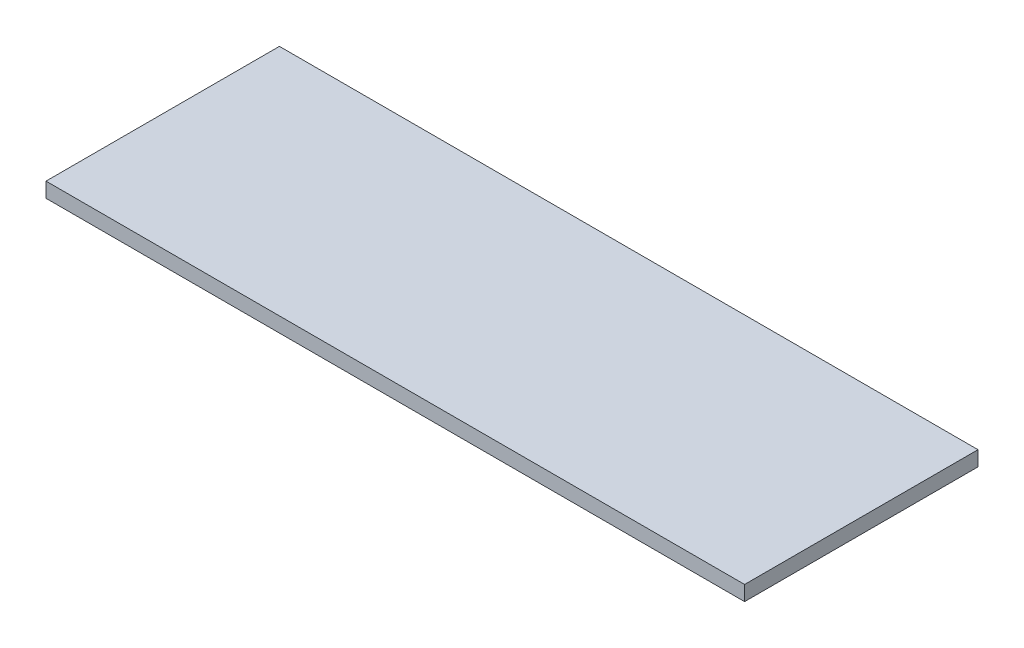
ISO-10303-21;
HEADER;
FILE_DESCRIPTION(('STEP AP214'),'2;1');
FILE_NAME('part.step','',(''),(''),'','','');
FILE_SCHEMA(('AUTOMOTIVE_DESIGN { 1 0 10303 214 1 1 1 1 }'));
ENDSEC;
DATA;
#1=APPLICATION_CONTEXT('core data for automotive mechanical design processes');
#2=APPLICATION_PROTOCOL_DEFINITION('international standard','automotive_design',2000,#1);
#3=PRODUCT_CONTEXT('',#1,'mechanical');
#4=PRODUCT('Part','Part','',(#3));
#5=PRODUCT_RELATED_PRODUCT_CATEGORY('part','',(#4));
#6=PRODUCT_DEFINITION_FORMATION('','',#4);
#7=PRODUCT_DEFINITION_CONTEXT('part definition',#1,'design');
#8=PRODUCT_DEFINITION('design','',#6,#7);
#9=PRODUCT_DEFINITION_SHAPE('','',#8);
#10=(LENGTH_UNIT() NAMED_UNIT(*) SI_UNIT(.MILLI.,.METRE.));
#11=(NAMED_UNIT(*) PLANE_ANGLE_UNIT() SI_UNIT($,.RADIAN.));
#12=(NAMED_UNIT(*) SI_UNIT($,.STERADIAN.) SOLID_ANGLE_UNIT());
#13=UNCERTAINTY_MEASURE_WITH_UNIT(LENGTH_MEASURE(1.E-05),#10,'distance_accuracy_value','');
#14=(GEOMETRIC_REPRESENTATION_CONTEXT(3) GLOBAL_UNCERTAINTY_ASSIGNED_CONTEXT((#13)) GLOBAL_UNIT_ASSIGNED_CONTEXT((#10,
#11,#12)) REPRESENTATION_CONTEXT('',''));
#15=CARTESIAN_POINT('',(0.,0.,0.));
#16=DIRECTION('',(0.,0.,1.));
#17=DIRECTION('',(1.,0.,0.));
#18=AXIS2_PLACEMENT_3D('',#15,#16,#17);
#19=CARTESIAN_POINT('',(-422.,18.,141.));
#20=DIRECTION('',(1.,0.,0.));
#21=DIRECTION('',(0.,0.,-1.));
#22=AXIS2_PLACEMENT_3D('',#19,#20,#21);
#23=PLANE('',#22);
#24=DIRECTION('',(0.,0.,1.));
#25=VECTOR('',#24,1.);
#26=CARTESIAN_POINT('',(-422.,0.,141.));
#27=LINE('',#26,#25);
#28=CARTESIAN_POINT('',(-422.,0.,-141.));
#29=VERTEX_POINT('',#28);
#30=CARTESIAN_POINT('',(-422.,0.,141.));
#31=VERTEX_POINT('',#30);
#32=EDGE_CURVE('E98',#29,#31,#27,.T.);
#33=ORIENTED_EDGE('',*,*,#32,.T.);
#34=DIRECTION('',(0.,-1.,0.));
#35=VECTOR('',#34,1.);
#36=CARTESIAN_POINT('',(-422.,18.,141.));
#37=LINE('',#36,#35);
#38=CARTESIAN_POINT('',(-422.,18.,141.));
#39=VERTEX_POINT('',#38);
#40=EDGE_CURVE('E11',#39,#31,#37,.T.);
#41=ORIENTED_EDGE('',*,*,#40,.F.);
#42=DIRECTION('',(0.,0.,1.));
#43=VECTOR('',#42,1.);
#44=CARTESIAN_POINT('',(-422.,18.,141.));
#45=LINE('',#44,#43);
#46=CARTESIAN_POINT('',(-422.,18.,-141.));
#47=VERTEX_POINT('',#46);
#48=EDGE_CURVE('E86',#47,#39,#45,.T.);
#49=ORIENTED_EDGE('',*,*,#48,.F.);
#50=DIRECTION('',(0.,-1.,0.));
#51=VECTOR('',#50,1.);
#52=CARTESIAN_POINT('',(-422.,18.,-141.));
#53=LINE('',#52,#51);
#54=EDGE_CURVE('E94',#47,#29,#53,.T.);
#55=ORIENTED_EDGE('',*,*,#54,.T.);
#56=EDGE_LOOP('',(#33,#41,#49,#55));
#57=FACE_BOUND('',#56,.T.);
#58=ADVANCED_FACE('F35',(#57),#23,.F.);
#59=CARTESIAN_POINT('',(422.,18.,141.));
#60=DIRECTION('',(0.,0.,-1.));
#61=DIRECTION('',(-1.,0.,0.));
#62=AXIS2_PLACEMENT_3D('',#59,#60,#61);
#63=PLANE('',#62);
#64=DIRECTION('',(1.,0.,0.));
#65=VECTOR('',#64,1.);
#66=CARTESIAN_POINT('',(422.,0.,141.));
#67=LINE('',#66,#65);
#68=CARTESIAN_POINT('',(422.,0.,141.));
#69=VERTEX_POINT('',#68);
#70=EDGE_CURVE('E90',#31,#69,#67,.T.);
#71=ORIENTED_EDGE('',*,*,#70,.T.);
#72=DIRECTION('',(0.,-1.,0.));
#73=VECTOR('',#72,1.);
#74=CARTESIAN_POINT('',(422.,18.,141.));
#75=LINE('',#74,#73);
#76=CARTESIAN_POINT('',(422.,18.,141.));
#77=VERTEX_POINT('',#76);
#78=EDGE_CURVE('E43',#77,#69,#75,.T.);
#79=ORIENTED_EDGE('',*,*,#78,.F.);
#80=DIRECTION('',(1.,0.,0.));
#81=VECTOR('',#80,1.);
#82=CARTESIAN_POINT('',(422.,18.,141.));
#83=LINE('',#82,#81);
#84=EDGE_CURVE('E81',#39,#77,#83,.T.);
#85=ORIENTED_EDGE('',*,*,#84,.F.);
#86=ORIENTED_EDGE('',*,*,#40,.T.);
#87=EDGE_LOOP('',(#71,#79,#85,#86));
#88=FACE_BOUND('',#87,.T.);
#89=ADVANCED_FACE('F89',(#88),#63,.F.);
#90=CARTESIAN_POINT('',(422.,18.,141.));
#91=DIRECTION('',(-1.,0.,0.));
#92=DIRECTION('',(0.,0.,1.));
#93=AXIS2_PLACEMENT_3D('',#90,#91,#92);
#94=PLANE('',#93);
#95=DIRECTION('',(0.,0.,-1.));
#96=VECTOR('',#95,1.);
#97=CARTESIAN_POINT('',(422.,0.,141.));
#98=LINE('',#97,#96);
#99=CARTESIAN_POINT('',(422.,0.,-141.));
#100=VERTEX_POINT('',#99);
#101=EDGE_CURVE('E68',#69,#100,#98,.T.);
#102=ORIENTED_EDGE('',*,*,#101,.T.);
#103=DIRECTION('',(0.,-1.,0.));
#104=VECTOR('',#103,1.);
#105=CARTESIAN_POINT('',(422.,18.,-141.));
#106=LINE('',#105,#104);
#107=CARTESIAN_POINT('',(422.,18.,-141.));
#108=VERTEX_POINT('',#107);
#109=EDGE_CURVE('E91',#108,#100,#106,.T.);
#110=ORIENTED_EDGE('',*,*,#109,.F.);
#111=DIRECTION('',(0.,0.,-1.));
#112=VECTOR('',#111,1.);
#113=CARTESIAN_POINT('',(422.,18.,141.));
#114=LINE('',#113,#112);
#115=EDGE_CURVE('E84',#77,#108,#114,.T.);
#116=ORIENTED_EDGE('',*,*,#115,.F.);
#117=ORIENTED_EDGE('',*,*,#78,.T.);
#118=EDGE_LOOP('',(#102,#110,#116,#117));
#119=FACE_BOUND('',#118,.T.);
#120=ADVANCED_FACE('F92',(#119),#94,.F.);
#121=CARTESIAN_POINT('',(422.,18.,-141.));
#122=DIRECTION('',(0.,0.,1.));
#123=DIRECTION('',(1.,0.,0.));
#124=AXIS2_PLACEMENT_3D('',#121,#122,#123);
#125=PLANE('',#124);
#126=DIRECTION('',(-1.,0.,0.));
#127=VECTOR('',#126,1.);
#128=CARTESIAN_POINT('',(422.,0.,-141.));
#129=LINE('',#128,#127);
#130=EDGE_CURVE('E74',#100,#29,#129,.T.);
#131=ORIENTED_EDGE('',*,*,#130,.T.);
#132=ORIENTED_EDGE('',*,*,#54,.F.);
#133=DIRECTION('',(-1.,0.,0.));
#134=VECTOR('',#133,1.);
#135=CARTESIAN_POINT('',(422.,18.,-141.));
#136=LINE('',#135,#134);
#137=EDGE_CURVE('E51',#108,#47,#136,.T.);
#138=ORIENTED_EDGE('',*,*,#137,.F.);
#139=ORIENTED_EDGE('',*,*,#109,.T.);
#140=EDGE_LOOP('',(#131,#132,#138,#139));
#141=FACE_BOUND('',#140,.T.);
#142=ADVANCED_FACE('F105',(#141),#125,.F.);
#143=CARTESIAN_POINT('',(0.,18.,0.));
#144=DIRECTION('',(0.,1.,0.));
#145=DIRECTION('',(0.,0.,1.));
#146=AXIS2_PLACEMENT_3D('',#143,#144,#145);
#147=PLANE('',#146);
#148=ORIENTED_EDGE('',*,*,#48,.T.);
#149=ORIENTED_EDGE('',*,*,#84,.T.);
#150=ORIENTED_EDGE('',*,*,#115,.T.);
#151=ORIENTED_EDGE('',*,*,#137,.T.);
#152=EDGE_LOOP('',(#148,#149,#150,#151));
#153=FACE_BOUND('',#152,.T.);
#154=ADVANCED_FACE('F82',(#153),#147,.T.);
#155=CARTESIAN_POINT('',(0.,0.,0.));
#156=DIRECTION('',(0.,1.,0.));
#157=DIRECTION('',(0.,0.,1.));
#158=AXIS2_PLACEMENT_3D('',#155,#156,#157);
#159=PLANE('',#158);
#160=ORIENTED_EDGE('',*,*,#32,.F.);
#161=ORIENTED_EDGE('',*,*,#130,.F.);
#162=ORIENTED_EDGE('',*,*,#101,.F.);
#163=ORIENTED_EDGE('',*,*,#70,.F.);
#164=EDGE_LOOP('',(#160,#161,#162,#163));
#165=FACE_BOUND('',#164,.T.);
#166=ADVANCED_FACE('F108',(#165),#159,.F.);
#167=CLOSED_SHELL('',(#58,#89,#120,#142,#154,#166));
#168=MANIFOLD_SOLID_BREP('B2',#167);
#169=ADVANCED_BREP_SHAPE_REPRESENTATION('',(#18,#168),#14);
#170=SHAPE_DEFINITION_REPRESENTATION(#9,#169);
ENDSEC;
END-ISO-10303-21;
